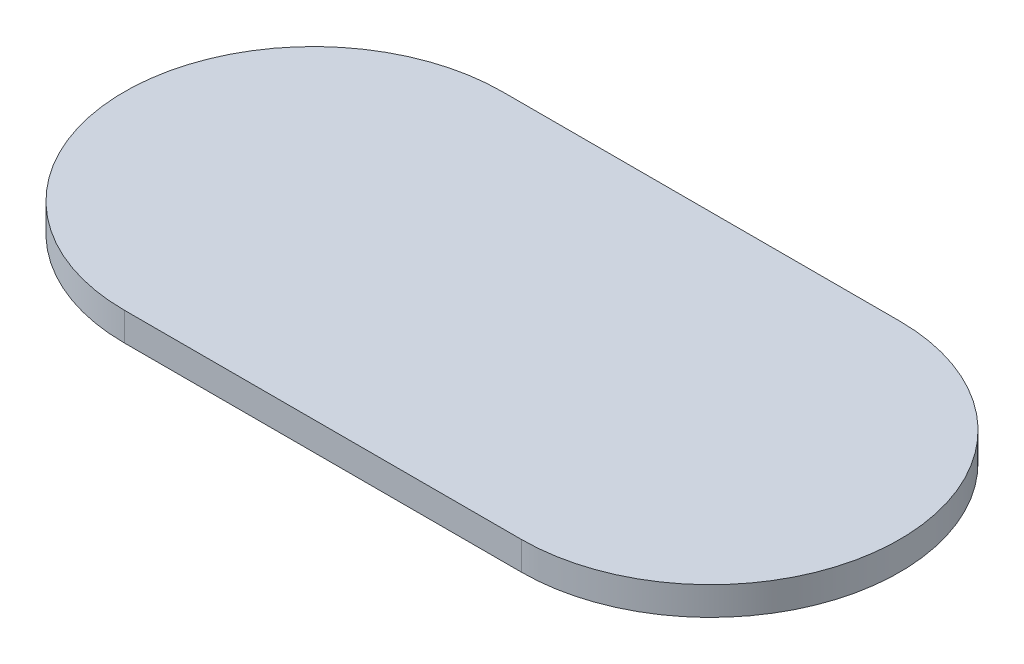
ISO-10303-21;
HEADER;
FILE_DESCRIPTION(('STEP AP214'),'2;1');
FILE_NAME('part.step','',(''),(''),'','','');
FILE_SCHEMA(('AUTOMOTIVE_DESIGN { 1 0 10303 214 1 1 1 1 }'));
ENDSEC;
DATA;
#1=APPLICATION_CONTEXT('core data for automotive mechanical design processes');
#2=APPLICATION_PROTOCOL_DEFINITION('international standard','automotive_design',2000,#1);
#3=PRODUCT_CONTEXT('',#1,'mechanical');
#4=PRODUCT('Part','Part','',(#3));
#5=PRODUCT_RELATED_PRODUCT_CATEGORY('part','',(#4));
#6=PRODUCT_DEFINITION_FORMATION('','',#4);
#7=PRODUCT_DEFINITION_CONTEXT('part definition',#1,'design');
#8=PRODUCT_DEFINITION('design','',#6,#7);
#9=PRODUCT_DEFINITION_SHAPE('','',#8);
#10=(LENGTH_UNIT() NAMED_UNIT(*) SI_UNIT(.MILLI.,.METRE.));
#11=(NAMED_UNIT(*) PLANE_ANGLE_UNIT() SI_UNIT($,.RADIAN.));
#12=(NAMED_UNIT(*) SI_UNIT($,.STERADIAN.) SOLID_ANGLE_UNIT());
#13=UNCERTAINTY_MEASURE_WITH_UNIT(LENGTH_MEASURE(1.E-05),#10,'distance_accuracy_value','');
#14=(GEOMETRIC_REPRESENTATION_CONTEXT(3) GLOBAL_UNCERTAINTY_ASSIGNED_CONTEXT((#13)) GLOBAL_UNIT_ASSIGNED_CONTEXT((#10,
#11,#12)) REPRESENTATION_CONTEXT('',''));
#15=CARTESIAN_POINT('',(0.,0.,0.));
#16=DIRECTION('',(0.,0.,1.));
#17=DIRECTION('',(1.,0.,0.));
#18=AXIS2_PLACEMENT_3D('',#15,#16,#17);
#19=CARTESIAN_POINT('',(26.67,3.81,0.));
#20=DIRECTION('',(0.,-1.,0.));
#21=DIRECTION('',(0.,0.,-1.));
#22=AXIS2_PLACEMENT_3D('',#19,#20,#21);
#23=CYLINDRICAL_SURFACE('',#22,25.4);
#24=CARTESIAN_POINT('',(26.67,0.,0.));
#25=DIRECTION('',(0.,1.,0.));
#26=DIRECTION('',(0.,0.,-1.));
#27=AXIS2_PLACEMENT_3D('',#24,#25,#26);
#28=CIRCLE('',#27,25.4);
#29=CARTESIAN_POINT('',(26.67,0.,25.4));
#30=VERTEX_POINT('',#29);
#31=CARTESIAN_POINT('',(26.67,0.,-25.4));
#32=VERTEX_POINT('',#31);
#33=EDGE_CURVE('E96',#30,#32,#28,.T.);
#34=ORIENTED_EDGE('',*,*,#33,.T.);
#35=DIRECTION('',(0.,-1.,0.));
#36=VECTOR('',#35,1.);
#37=CARTESIAN_POINT('',(26.67,3.81,-25.4));
#38=LINE('',#37,#36);
#39=CARTESIAN_POINT('',(26.67,3.81,-25.4));
#40=VERTEX_POINT('',#39);
#41=EDGE_CURVE('E11',#40,#32,#38,.T.);
#42=ORIENTED_EDGE('',*,*,#41,.F.);
#43=CARTESIAN_POINT('',(26.67,3.81,0.));
#44=DIRECTION('',(0.,1.,0.));
#45=DIRECTION('',(0.,0.,-1.));
#46=AXIS2_PLACEMENT_3D('',#43,#44,#45);
#47=CIRCLE('',#46,25.4);
#48=CARTESIAN_POINT('',(26.67,3.81,25.4));
#49=VERTEX_POINT('',#48);
#50=EDGE_CURVE('E84',#49,#40,#47,.T.);
#51=ORIENTED_EDGE('',*,*,#50,.F.);
#52=DIRECTION('',(0.,-1.,0.));
#53=VECTOR('',#52,1.);
#54=CARTESIAN_POINT('',(26.67,3.81,25.4));
#55=LINE('',#54,#53);
#56=EDGE_CURVE('E92',#49,#30,#55,.T.);
#57=ORIENTED_EDGE('',*,*,#56,.T.);
#58=EDGE_LOOP('',(#34,#42,#51,#57));
#59=FACE_BOUND('',#58,.T.);
#60=ADVANCED_FACE('F33',(#59),#23,.T.);
#61=CARTESIAN_POINT('',(-26.67,3.81,-25.4));
#62=DIRECTION('',(0.,0.,1.));
#63=DIRECTION('',(1.,0.,0.));
#64=AXIS2_PLACEMENT_3D('',#61,#62,#63);
#65=PLANE('',#64);
#66=DIRECTION('',(-1.,0.,0.));
#67=VECTOR('',#66,1.);
#68=CARTESIAN_POINT('',(-26.67,0.,-25.4));
#69=LINE('',#68,#67);
#70=CARTESIAN_POINT('',(-26.67,0.,-25.4));
#71=VERTEX_POINT('',#70);
#72=EDGE_CURVE('E88',#32,#71,#69,.T.);
#73=ORIENTED_EDGE('',*,*,#72,.T.);
#74=DIRECTION('',(0.,-1.,0.));
#75=VECTOR('',#74,1.);
#76=CARTESIAN_POINT('',(-26.67,3.81,-25.4));
#77=LINE('',#76,#75);
#78=CARTESIAN_POINT('',(-26.67,3.81,-25.4));
#79=VERTEX_POINT('',#78);
#80=EDGE_CURVE('E41',#79,#71,#77,.T.);
#81=ORIENTED_EDGE('',*,*,#80,.F.);
#82=DIRECTION('',(-1.,0.,0.));
#83=VECTOR('',#82,1.);
#84=CARTESIAN_POINT('',(-26.67,3.81,-25.4));
#85=LINE('',#84,#83);
#86=EDGE_CURVE('E79',#40,#79,#85,.T.);
#87=ORIENTED_EDGE('',*,*,#86,.F.);
#88=ORIENTED_EDGE('',*,*,#41,.T.);
#89=EDGE_LOOP('',(#73,#81,#87,#88));
#90=FACE_BOUND('',#89,.T.);
#91=ADVANCED_FACE('F87',(#90),#65,.F.);
#92=CARTESIAN_POINT('',(-26.67,3.81,0.));
#93=DIRECTION('',(0.,-1.,0.));
#94=DIRECTION('',(0.,0.,-1.));
#95=AXIS2_PLACEMENT_3D('',#92,#93,#94);
#96=CYLINDRICAL_SURFACE('',#95,25.4);
#97=CARTESIAN_POINT('',(-26.67,0.,0.));
#98=DIRECTION('',(0.,1.,0.));
#99=DIRECTION('',(0.,0.,1.));
#100=AXIS2_PLACEMENT_3D('',#97,#98,#99);
#101=CIRCLE('',#100,25.4);
#102=CARTESIAN_POINT('',(-26.67,0.,25.4));
#103=VERTEX_POINT('',#102);
#104=EDGE_CURVE('E66',#71,#103,#101,.T.);
#105=ORIENTED_EDGE('',*,*,#104,.T.);
#106=DIRECTION('',(0.,-1.,0.));
#107=VECTOR('',#106,1.);
#108=CARTESIAN_POINT('',(-26.67,3.81,25.4));
#109=LINE('',#108,#107);
#110=CARTESIAN_POINT('',(-26.67,3.81,25.4));
#111=VERTEX_POINT('',#110);
#112=EDGE_CURVE('E89',#111,#103,#109,.T.);
#113=ORIENTED_EDGE('',*,*,#112,.F.);
#114=CARTESIAN_POINT('',(-26.67,3.81,0.));
#115=DIRECTION('',(0.,1.,0.));
#116=DIRECTION('',(0.,0.,1.));
#117=AXIS2_PLACEMENT_3D('',#114,#115,#116);
#118=CIRCLE('',#117,25.4);
#119=EDGE_CURVE('E82',#79,#111,#118,.T.);
#120=ORIENTED_EDGE('',*,*,#119,.F.);
#121=ORIENTED_EDGE('',*,*,#80,.T.);
#122=EDGE_LOOP('',(#105,#113,#120,#121));
#123=FACE_BOUND('',#122,.T.);
#124=ADVANCED_FACE('F90',(#123),#96,.T.);
#125=CARTESIAN_POINT('',(-26.6699999999999,3.81,25.4));
#126=DIRECTION('',(0.,0.,-1.));
#127=DIRECTION('',(-1.,0.,0.));
#128=AXIS2_PLACEMENT_3D('',#125,#126,#127);
#129=PLANE('',#128);
#130=DIRECTION('',(1.,0.,0.));
#131=VECTOR('',#130,1.);
#132=CARTESIAN_POINT('',(-26.6699999999999,0.,25.4));
#133=LINE('',#132,#131);
#134=EDGE_CURVE('E72',#103,#30,#133,.T.);
#135=ORIENTED_EDGE('',*,*,#134,.T.);
#136=ORIENTED_EDGE('',*,*,#56,.F.);
#137=DIRECTION('',(1.,0.,0.));
#138=VECTOR('',#137,1.);
#139=CARTESIAN_POINT('',(-26.6699999999999,3.81,25.4));
#140=LINE('',#139,#138);
#141=EDGE_CURVE('E49',#111,#49,#140,.T.);
#142=ORIENTED_EDGE('',*,*,#141,.F.);
#143=ORIENTED_EDGE('',*,*,#112,.T.);
#144=EDGE_LOOP('',(#135,#136,#142,#143));
#145=FACE_BOUND('',#144,.T.);
#146=ADVANCED_FACE('F103',(#145),#129,.F.);
#147=CARTESIAN_POINT('',(26.67,3.81,0.));
#148=DIRECTION('',(0.,-1.,0.));
#149=DIRECTION('',(0.,0.,-1.));
#150=AXIS2_PLACEMENT_3D('',#147,#148,#149);
#151=PLANE('',#150);
#152=ORIENTED_EDGE('',*,*,#50,.T.);
#153=ORIENTED_EDGE('',*,*,#86,.T.);
#154=ORIENTED_EDGE('',*,*,#119,.T.);
#155=ORIENTED_EDGE('',*,*,#141,.T.);
#156=EDGE_LOOP('',(#152,#153,#154,#155));
#157=FACE_BOUND('',#156,.T.);
#158=ADVANCED_FACE('F80',(#157),#151,.F.);
#159=CARTESIAN_POINT('',(26.67,0.,0.));
#160=DIRECTION('',(0.,-1.,0.));
#161=DIRECTION('',(0.,0.,-1.));
#162=AXIS2_PLACEMENT_3D('',#159,#160,#161);
#163=PLANE('',#162);
#164=ORIENTED_EDGE('',*,*,#33,.F.);
#165=ORIENTED_EDGE('',*,*,#134,.F.);
#166=ORIENTED_EDGE('',*,*,#104,.F.);
#167=ORIENTED_EDGE('',*,*,#72,.F.);
#168=EDGE_LOOP('',(#164,#165,#166,#167));
#169=FACE_BOUND('',#168,.T.);
#170=ADVANCED_FACE('F106',(#169),#163,.T.);
#171=CLOSED_SHELL('',(#60,#91,#124,#146,#158,#170));
#172=MANIFOLD_SOLID_BREP('B2',#171);
#173=ADVANCED_BREP_SHAPE_REPRESENTATION('',(#18,#172),#14);
#174=SHAPE_DEFINITION_REPRESENTATION(#9,#173);
ENDSEC;
END-ISO-10303-21;
